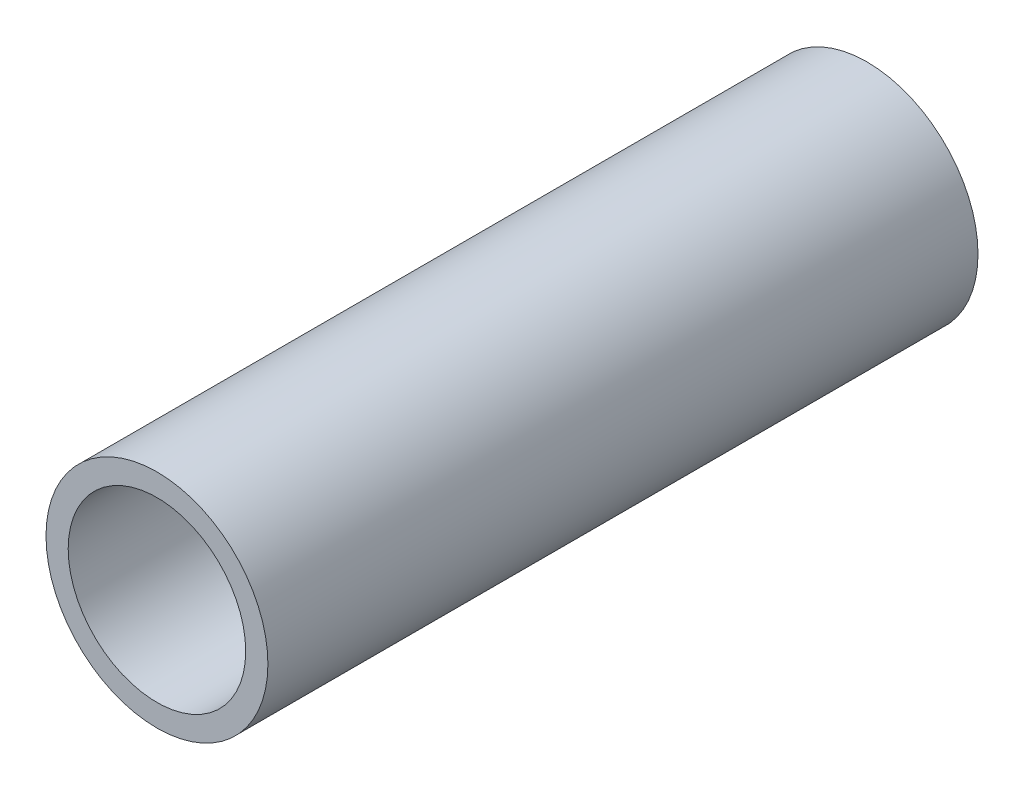
ISO-10303-21;
HEADER;
FILE_DESCRIPTION(('STEP AP214'),'2;1');
FILE_NAME('part.step','',(''),(''),'','','');
FILE_SCHEMA(('AUTOMOTIVE_DESIGN { 1 0 10303 214 1 1 1 1 }'));
ENDSEC;
DATA;
#1=APPLICATION_CONTEXT('core data for automotive mechanical design processes');
#2=APPLICATION_PROTOCOL_DEFINITION('international standard','automotive_design',2000,#1);
#3=PRODUCT_CONTEXT('',#1,'mechanical');
#4=PRODUCT('Part','Part','',(#3));
#5=PRODUCT_RELATED_PRODUCT_CATEGORY('part','',(#4));
#6=PRODUCT_DEFINITION_FORMATION('','',#4);
#7=PRODUCT_DEFINITION_CONTEXT('part definition',#1,'design');
#8=PRODUCT_DEFINITION('design','',#6,#7);
#9=PRODUCT_DEFINITION_SHAPE('','',#8);
#10=(LENGTH_UNIT() NAMED_UNIT(*) SI_UNIT(.MILLI.,.METRE.));
#11=(NAMED_UNIT(*) PLANE_ANGLE_UNIT() SI_UNIT($,.RADIAN.));
#12=(NAMED_UNIT(*) SI_UNIT($,.STERADIAN.) SOLID_ANGLE_UNIT());
#13=UNCERTAINTY_MEASURE_WITH_UNIT(LENGTH_MEASURE(1.E-05),#10,'distance_accuracy_value','');
#14=(GEOMETRIC_REPRESENTATION_CONTEXT(3) GLOBAL_UNCERTAINTY_ASSIGNED_CONTEXT((#13)) GLOBAL_UNIT_ASSIGNED_CONTEXT((#10,
#11,#12)) REPRESENTATION_CONTEXT('',''));
#15=CARTESIAN_POINT('',(0.,0.,0.));
#16=DIRECTION('',(0.,0.,1.));
#17=DIRECTION('',(1.,0.,0.));
#18=AXIS2_PLACEMENT_3D('',#15,#16,#17);
#19=CARTESIAN_POINT('',(0.,0.,8.));
#20=DIRECTION('',(0.,0.,1.));
#21=DIRECTION('',(1.,0.,0.));
#22=AXIS2_PLACEMENT_3D('',#19,#20,#21);
#23=PLANE('',#22);
#24=CARTESIAN_POINT('',(0.,0.,8.));
#25=DIRECTION('',(0.,0.,1.));
#26=DIRECTION('',(1.,0.,0.));
#27=AXIS2_PLACEMENT_3D('',#24,#25,#26);
#28=CIRCLE('',#27,1.25);
#29=CARTESIAN_POINT('',(1.25,0.,8.));
#30=VERTEX_POINT('',#29);
#31=EDGE_CURVE('E10',#30,#30,#28,.T.);
#32=ORIENTED_EDGE('',*,*,#31,.T.);
#33=EDGE_LOOP('',(#32));
#34=FACE_BOUND('',#33,.T.);
#35=CARTESIAN_POINT('',(0.,0.,8.));
#36=DIRECTION('',(0.,0.,1.));
#37=DIRECTION('',(1.,0.,0.));
#38=AXIS2_PLACEMENT_3D('',#35,#36,#37);
#39=CIRCLE('',#38,1.);
#40=CARTESIAN_POINT('',(1.,0.,8.));
#41=VERTEX_POINT('',#40);
#42=EDGE_CURVE('E42',#41,#41,#39,.T.);
#43=ORIENTED_EDGE('',*,*,#42,.F.);
#44=EDGE_LOOP('',(#43));
#45=FACE_BOUND('',#44,.T.);
#46=ADVANCED_FACE('F31',(#34,#45),#23,.T.);
#47=CARTESIAN_POINT('',(0.,0.,0.));
#48=DIRECTION('',(0.,0.,1.));
#49=DIRECTION('',(1.,0.,0.));
#50=AXIS2_PLACEMENT_3D('',#47,#48,#49);
#51=PLANE('',#50);
#52=CARTESIAN_POINT('',(0.,0.,0.));
#53=DIRECTION('',(0.,0.,1.));
#54=DIRECTION('',(1.,0.,0.));
#55=AXIS2_PLACEMENT_3D('',#52,#53,#54);
#56=CIRCLE('',#55,1.25);
#57=CARTESIAN_POINT('',(1.25,0.,0.));
#58=VERTEX_POINT('',#57);
#59=EDGE_CURVE('E35',#58,#58,#56,.T.);
#60=ORIENTED_EDGE('',*,*,#59,.F.);
#61=EDGE_LOOP('',(#60));
#62=FACE_BOUND('',#61,.T.);
#63=CARTESIAN_POINT('',(0.,0.,0.));
#64=DIRECTION('',(0.,0.,1.));
#65=DIRECTION('',(1.,0.,0.));
#66=AXIS2_PLACEMENT_3D('',#63,#64,#65);
#67=CIRCLE('',#66,1.);
#68=CARTESIAN_POINT('',(1.,0.,0.));
#69=VERTEX_POINT('',#68);
#70=EDGE_CURVE('E44',#69,#69,#67,.T.);
#71=ORIENTED_EDGE('',*,*,#70,.T.);
#72=EDGE_LOOP('',(#71));
#73=FACE_BOUND('',#72,.T.);
#74=ADVANCED_FACE('F54',(#62,#73),#51,.F.);
#75=CARTESIAN_POINT('',(0.,0.,8.));
#76=DIRECTION('',(0.,0.,-1.));
#77=DIRECTION('',(-1.,0.,0.));
#78=AXIS2_PLACEMENT_3D('',#75,#76,#77);
#79=CYLINDRICAL_SURFACE('',#78,1.25);
#80=ORIENTED_EDGE('',*,*,#31,.F.);
#81=EDGE_LOOP('',(#80));
#82=FACE_BOUND('',#81,.T.);
#83=ORIENTED_EDGE('',*,*,#59,.T.);
#84=EDGE_LOOP('',(#83));
#85=FACE_BOUND('',#84,.T.);
#86=ADVANCED_FACE('F33',(#82,#85),#79,.T.);
#87=CARTESIAN_POINT('',(0.,0.,8.));
#88=DIRECTION('',(0.,0.,-1.));
#89=DIRECTION('',(-1.,0.,0.));
#90=AXIS2_PLACEMENT_3D('',#87,#88,#89);
#91=CYLINDRICAL_SURFACE('',#90,1.);
#92=ORIENTED_EDGE('',*,*,#42,.T.);
#93=EDGE_LOOP('',(#92));
#94=FACE_BOUND('',#93,.T.);
#95=ORIENTED_EDGE('',*,*,#70,.F.);
#96=EDGE_LOOP('',(#95));
#97=FACE_BOUND('',#96,.T.);
#98=ADVANCED_FACE('F50',(#94,#97),#91,.F.);
#99=CLOSED_SHELL('',(#46,#74,#86,#98));
#100=MANIFOLD_SOLID_BREP('B2',#99);
#101=ADVANCED_BREP_SHAPE_REPRESENTATION('',(#18,#100),#14);
#102=SHAPE_DEFINITION_REPRESENTATION(#9,#101);
ENDSEC;
END-ISO-10303-21;
